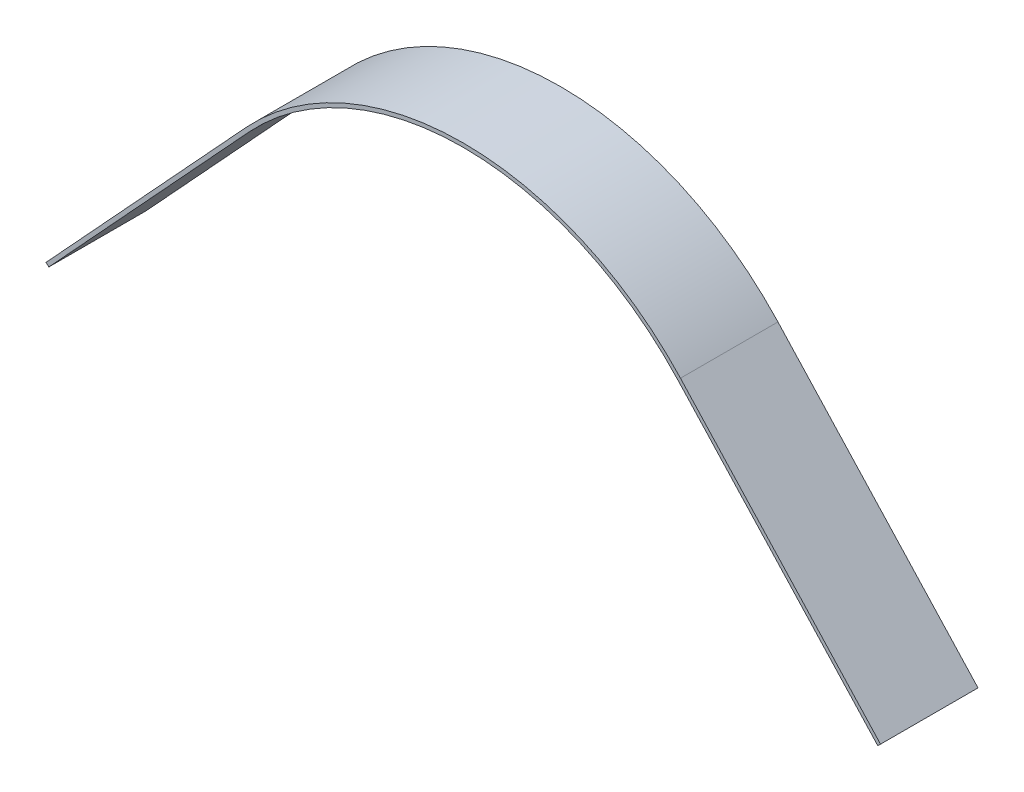
ISO-10303-21;
HEADER;
FILE_DESCRIPTION(('STEP AP214'),'2;1');
FILE_NAME('part.step','',(''),(''),'','','');
FILE_SCHEMA(('AUTOMOTIVE_DESIGN { 1 0 10303 214 1 1 1 1 }'));
ENDSEC;
DATA;
#1=APPLICATION_CONTEXT('core data for automotive mechanical design processes');
#2=APPLICATION_PROTOCOL_DEFINITION('international standard','automotive_design',2000,#1);
#3=PRODUCT_CONTEXT('',#1,'mechanical');
#4=PRODUCT('Part','Part','',(#3));
#5=PRODUCT_RELATED_PRODUCT_CATEGORY('part','',(#4));
#6=PRODUCT_DEFINITION_FORMATION('','',#4);
#7=PRODUCT_DEFINITION_CONTEXT('part definition',#1,'design');
#8=PRODUCT_DEFINITION('design','',#6,#7);
#9=PRODUCT_DEFINITION_SHAPE('','',#8);
#10=(LENGTH_UNIT() NAMED_UNIT(*) SI_UNIT(.MILLI.,.METRE.));
#11=(NAMED_UNIT(*) PLANE_ANGLE_UNIT() SI_UNIT($,.RADIAN.));
#12=(NAMED_UNIT(*) SI_UNIT($,.STERADIAN.) SOLID_ANGLE_UNIT());
#13=UNCERTAINTY_MEASURE_WITH_UNIT(LENGTH_MEASURE(1.E-05),#10,'distance_accuracy_value','');
#14=(GEOMETRIC_REPRESENTATION_CONTEXT(3) GLOBAL_UNCERTAINTY_ASSIGNED_CONTEXT((#13)) GLOBAL_UNIT_ASSIGNED_CONTEXT((#10,
#11,#12)) REPRESENTATION_CONTEXT('',''));
#15=CARTESIAN_POINT('',(0.,0.,0.));
#16=DIRECTION('',(0.,0.,1.));
#17=DIRECTION('',(1.,0.,0.));
#18=AXIS2_PLACEMENT_3D('',#15,#16,#17);
#19=CARTESIAN_POINT('',(55.8669255547084,51.5255919817005,12.7));
#20=DIRECTION('',(0.735091125719847,0.67796831554869,0.));
#21=DIRECTION('',(-0.67796831554869,0.735091125719847,0.));
#22=AXIS2_PLACEMENT_3D('',#19,#20,#21);
#23=PLANE('',#22);
#24=DIRECTION('',(0.67796831554869,-0.735091125719847,0.));
#25=VECTOR('',#24,1.);
#26=CARTESIAN_POINT('',(55.8669255547084,51.5255919817005,-12.7));
#27=LINE('',#26,#25);
#28=CARTESIAN_POINT('',(55.8669255547084,51.5255919817005,-12.7));
#29=VERTEX_POINT('',#28);
#30=CARTESIAN_POINT('',(108.,-5.,-12.7));
#31=VERTEX_POINT('',#30);
#32=EDGE_CURVE('E132',#29,#31,#27,.T.);
#33=ORIENTED_EDGE('',*,*,#32,.T.);
#34=DIRECTION('',(0.,0.,-1.));
#35=VECTOR('',#34,1.);
#36=CARTESIAN_POINT('',(108.,-5.,12.7));
#37=LINE('',#36,#35);
#38=CARTESIAN_POINT('',(108.,-5.,12.7));
#39=VERTEX_POINT('',#38);
#40=EDGE_CURVE('E11',#39,#31,#37,.T.);
#41=ORIENTED_EDGE('',*,*,#40,.F.);
#42=DIRECTION('',(0.67796831554869,-0.735091125719847,0.));
#43=VECTOR('',#42,1.);
#44=CARTESIAN_POINT('',(55.8669255547084,51.5255919817005,12.7));
#45=LINE('',#44,#43);
#46=CARTESIAN_POINT('',(55.8669255547084,51.5255919817005,12.7));
#47=VERTEX_POINT('',#46);
#48=EDGE_CURVE('E90',#47,#39,#45,.T.);
#49=ORIENTED_EDGE('',*,*,#48,.F.);
#50=DIRECTION('',(0.,0.,-1.));
#51=VECTOR('',#50,1.);
#52=CARTESIAN_POINT('',(55.8669255547084,51.5255919817005,12.7));
#53=LINE('',#52,#51);
#54=EDGE_CURVE('E131',#47,#29,#53,.T.);
#55=ORIENTED_EDGE('',*,*,#54,.T.);
#56=EDGE_LOOP('',(#33,#41,#49,#55));
#57=FACE_BOUND('',#56,.T.);
#58=ADVANCED_FACE('F35',(#57),#23,.F.);
#59=CARTESIAN_POINT('',(108.73509112572,-4.32203168445131,12.7));
#60=DIRECTION('',(0.677968315548683,-0.735091125719853,0.));
#61=DIRECTION('',(0.735091125719853,0.677968315548683,0.));
#62=AXIS2_PLACEMENT_3D('',#59,#60,#61);
#63=PLANE('',#62);
#64=DIRECTION('',(-0.735091125719853,-0.677968315548683,0.));
#65=VECTOR('',#64,1.);
#66=CARTESIAN_POINT('',(108.73509112572,-4.32203168445131,-12.7));
#67=LINE('',#66,#65);
#68=CARTESIAN_POINT('',(108.73509112572,-4.32203168445131,-12.7));
#69=VERTEX_POINT('',#68);
#70=EDGE_CURVE('E135',#69,#31,#67,.T.);
#71=ORIENTED_EDGE('',*,*,#70,.F.);
#72=DIRECTION('',(0.,0.,-1.));
#73=VECTOR('',#72,1.);
#74=CARTESIAN_POINT('',(108.73509112572,-4.32203168445131,12.7));
#75=LINE('',#74,#73);
#76=CARTESIAN_POINT('',(108.73509112572,-4.32203168445131,12.7));
#77=VERTEX_POINT('',#76);
#78=EDGE_CURVE('E43',#77,#69,#75,.T.);
#79=ORIENTED_EDGE('',*,*,#78,.F.);
#80=DIRECTION('',(-0.735091125719853,-0.677968315548683,0.));
#81=VECTOR('',#80,1.);
#82=CARTESIAN_POINT('',(108.73509112572,-4.32203168445131,12.7));
#83=LINE('',#82,#81);
#84=EDGE_CURVE('E174',#77,#39,#83,.T.);
#85=ORIENTED_EDGE('',*,*,#84,.T.);
#86=ORIENTED_EDGE('',*,*,#40,.T.);
#87=EDGE_LOOP('',(#71,#79,#85,#86));
#88=FACE_BOUND('',#87,.T.);
#89=ADVANCED_FACE('F165',(#88),#63,.T.);
#90=CARTESIAN_POINT('',(56.6020166804282,52.2035602972492,12.7));
#91=DIRECTION('',(0.735091125719847,0.67796831554869,0.));
#92=DIRECTION('',(-0.67796831554869,0.735091125719847,0.));
#93=AXIS2_PLACEMENT_3D('',#90,#91,#92);
#94=PLANE('',#93);
#95=DIRECTION('',(0.67796831554869,-0.735091125719847,0.));
#96=VECTOR('',#95,1.);
#97=CARTESIAN_POINT('',(56.6020166804282,52.2035602972492,-12.7));
#98=LINE('',#97,#96);
#99=CARTESIAN_POINT('',(56.6020166804282,52.2035602972492,-12.7));
#100=VERTEX_POINT('',#99);
#101=EDGE_CURVE('E138',#100,#69,#98,.T.);
#102=ORIENTED_EDGE('',*,*,#101,.F.);
#103=DIRECTION('',(0.,0.,-1.));
#104=VECTOR('',#103,1.);
#105=CARTESIAN_POINT('',(56.6020166804282,52.2035602972492,12.7));
#106=LINE('',#105,#104);
#107=CARTESIAN_POINT('',(56.6020166804282,52.2035602972492,12.7));
#108=VERTEX_POINT('',#107);
#109=EDGE_CURVE('E155',#108,#100,#106,.T.);
#110=ORIENTED_EDGE('',*,*,#109,.F.);
#111=DIRECTION('',(0.67796831554869,-0.735091125719847,0.));
#112=VECTOR('',#111,1.);
#113=CARTESIAN_POINT('',(56.6020166804282,52.2035602972492,12.7));
#114=LINE('',#113,#112);
#115=EDGE_CURVE('E162',#108,#77,#114,.T.);
#116=ORIENTED_EDGE('',*,*,#115,.T.);
#117=ORIENTED_EDGE('',*,*,#78,.T.);
#118=EDGE_LOOP('',(#102,#110,#116,#117));
#119=FACE_BOUND('',#118,.T.);
#120=ADVANCED_FACE('F160',(#119),#94,.T.);
#121=CARTESIAN_POINT('',(0.,0.,12.7));
#122=DIRECTION('',(0.,0.,-1.));
#123=DIRECTION('',(-1.,0.,0.));
#124=AXIS2_PLACEMENT_3D('',#121,#122,#123);
#125=CYLINDRICAL_SURFACE('',#124,77.);
#126=CARTESIAN_POINT('',(0.,0.,-12.7));
#127=DIRECTION('',(0.,0.,1.));
#128=DIRECTION('',(1.,0.,0.));
#129=AXIS2_PLACEMENT_3D('',#126,#127,#128);
#130=CIRCLE('',#129,77.);
#131=CARTESIAN_POINT('',(-56.6020166804282,52.2035602972491,-12.7));
#132=VERTEX_POINT('',#131);
#133=EDGE_CURVE('E141',#132,#100,#130,.F.);
#134=ORIENTED_EDGE('',*,*,#133,.F.);
#135=DIRECTION('',(0.,0.,-1.));
#136=VECTOR('',#135,1.);
#137=CARTESIAN_POINT('',(-56.6020166804282,52.2035602972491,12.7));
#138=LINE('',#137,#136);
#139=CARTESIAN_POINT('',(-56.6020166804282,52.2035602972491,12.7));
#140=VERTEX_POINT('',#139);
#141=EDGE_CURVE('E153',#140,#132,#138,.T.);
#142=ORIENTED_EDGE('',*,*,#141,.F.);
#143=CARTESIAN_POINT('',(0.,0.,12.7));
#144=DIRECTION('',(0.,0.,1.));
#145=DIRECTION('',(1.,0.,0.));
#146=AXIS2_PLACEMENT_3D('',#143,#144,#145);
#147=CIRCLE('',#146,77.);
#148=EDGE_CURVE('E126',#140,#108,#147,.F.);
#149=ORIENTED_EDGE('',*,*,#148,.T.);
#150=ORIENTED_EDGE('',*,*,#109,.T.);
#151=EDGE_LOOP('',(#134,#142,#149,#150));
#152=FACE_BOUND('',#151,.T.);
#153=ADVANCED_FACE('F172',(#152),#125,.T.);
#154=CARTESIAN_POINT('',(-56.6020166804282,52.2035602972491,12.7));
#155=DIRECTION('',(-0.735091125719847,0.67796831554869,0.));
#156=DIRECTION('',(-0.67796831554869,-0.735091125719847,0.));
#157=AXIS2_PLACEMENT_3D('',#154,#155,#156);
#158=PLANE('',#157);
#159=DIRECTION('',(0.67796831554869,0.735091125719847,0.));
#160=VECTOR('',#159,1.);
#161=CARTESIAN_POINT('',(-56.6020166804282,52.2035602972491,-12.7));
#162=LINE('',#161,#160);
#163=CARTESIAN_POINT('',(-108.73509112572,-4.32203168445131,-12.7));
#164=VERTEX_POINT('',#163);
#165=EDGE_CURVE('E144',#164,#132,#162,.T.);
#166=ORIENTED_EDGE('',*,*,#165,.F.);
#167=DIRECTION('',(0.,0.,-1.));
#168=VECTOR('',#167,1.);
#169=CARTESIAN_POINT('',(-108.73509112572,-4.32203168445131,12.7));
#170=LINE('',#169,#168);
#171=CARTESIAN_POINT('',(-108.73509112572,-4.32203168445131,12.7));
#172=VERTEX_POINT('',#171);
#173=EDGE_CURVE('E114',#172,#164,#170,.T.);
#174=ORIENTED_EDGE('',*,*,#173,.F.);
#175=DIRECTION('',(0.67796831554869,0.735091125719847,0.));
#176=VECTOR('',#175,1.);
#177=CARTESIAN_POINT('',(-56.6020166804282,52.2035602972491,12.7));
#178=LINE('',#177,#176);
#179=EDGE_CURVE('E124',#172,#140,#178,.T.);
#180=ORIENTED_EDGE('',*,*,#179,.T.);
#181=ORIENTED_EDGE('',*,*,#141,.T.);
#182=EDGE_LOOP('',(#166,#174,#180,#181));
#183=FACE_BOUND('',#182,.T.);
#184=ADVANCED_FACE('F179',(#183),#158,.T.);
#185=CARTESIAN_POINT('',(-108.,-5.,12.7));
#186=DIRECTION('',(-0.677968315548683,-0.735091125719853,0.));
#187=DIRECTION('',(0.735091125719853,-0.677968315548683,0.));
#188=AXIS2_PLACEMENT_3D('',#185,#186,#187);
#189=PLANE('',#188);
#190=DIRECTION('',(-0.735091125719853,0.677968315548683,0.));
#191=VECTOR('',#190,1.);
#192=CARTESIAN_POINT('',(-108.,-5.,-12.7));
#193=LINE('',#192,#191);
#194=CARTESIAN_POINT('',(-108.,-5.,-12.7));
#195=VERTEX_POINT('',#194);
#196=EDGE_CURVE('E113',#195,#164,#193,.T.);
#197=ORIENTED_EDGE('',*,*,#196,.F.);
#198=DIRECTION('',(0.,0.,-1.));
#199=VECTOR('',#198,1.);
#200=CARTESIAN_POINT('',(-108.,-5.,12.7));
#201=LINE('',#200,#199);
#202=CARTESIAN_POINT('',(-108.,-5.,12.7));
#203=VERTEX_POINT('',#202);
#204=EDGE_CURVE('E107',#203,#195,#201,.T.);
#205=ORIENTED_EDGE('',*,*,#204,.F.);
#206=DIRECTION('',(-0.735091125719853,0.677968315548683,0.));
#207=VECTOR('',#206,1.);
#208=CARTESIAN_POINT('',(-108.,-5.,12.7));
#209=LINE('',#208,#207);
#210=EDGE_CURVE('E111',#203,#172,#209,.T.);
#211=ORIENTED_EDGE('',*,*,#210,.T.);
#212=ORIENTED_EDGE('',*,*,#173,.T.);
#213=EDGE_LOOP('',(#197,#205,#211,#212));
#214=FACE_BOUND('',#213,.T.);
#215=ADVANCED_FACE('F109',(#214),#189,.T.);
#216=CARTESIAN_POINT('',(-55.8669255547084,51.5255919817005,12.7));
#217=DIRECTION('',(-0.735091125719847,0.67796831554869,0.));
#218=DIRECTION('',(-0.67796831554869,-0.735091125719847,0.));
#219=AXIS2_PLACEMENT_3D('',#216,#217,#218);
#220=PLANE('',#219);
#221=DIRECTION('',(0.67796831554869,0.735091125719847,0.));
#222=VECTOR('',#221,1.);
#223=CARTESIAN_POINT('',(-55.8669255547084,51.5255919817005,-12.7));
#224=LINE('',#223,#222);
#225=CARTESIAN_POINT('',(-55.8669255547084,51.5255919817005,-12.7));
#226=VERTEX_POINT('',#225);
#227=EDGE_CURVE('E78',#195,#226,#224,.T.);
#228=ORIENTED_EDGE('',*,*,#227,.T.);
#229=DIRECTION('',(0.,0.,-1.));
#230=VECTOR('',#229,1.);
#231=CARTESIAN_POINT('',(-55.8669255547084,51.5255919817005,12.7));
#232=LINE('',#231,#230);
#233=CARTESIAN_POINT('',(-55.8669255547084,51.5255919817005,12.7));
#234=VERTEX_POINT('',#233);
#235=EDGE_CURVE('E115',#234,#226,#232,.T.);
#236=ORIENTED_EDGE('',*,*,#235,.F.);
#237=DIRECTION('',(0.67796831554869,0.735091125719847,0.));
#238=VECTOR('',#237,1.);
#239=CARTESIAN_POINT('',(-55.8669255547084,51.5255919817005,12.7));
#240=LINE('',#239,#238);
#241=EDGE_CURVE('E117',#203,#234,#240,.T.);
#242=ORIENTED_EDGE('',*,*,#241,.F.);
#243=ORIENTED_EDGE('',*,*,#204,.T.);
#244=EDGE_LOOP('',(#228,#236,#242,#243));
#245=FACE_BOUND('',#244,.T.);
#246=ADVANCED_FACE('F118',(#245),#220,.F.);
#247=CARTESIAN_POINT('',(0.,0.,12.7));
#248=DIRECTION('',(0.,0.,-1.));
#249=DIRECTION('',(-1.,0.,0.));
#250=AXIS2_PLACEMENT_3D('',#247,#248,#249);
#251=CYLINDRICAL_SURFACE('',#250,76.);
#252=CARTESIAN_POINT('',(0.,0.,-12.7));
#253=DIRECTION('',(0.,0.,-1.));
#254=DIRECTION('',(1.,0.,0.));
#255=AXIS2_PLACEMENT_3D('',#252,#253,#254);
#256=CIRCLE('',#255,76.);
#257=EDGE_CURVE('E84',#226,#29,#256,.T.);
#258=ORIENTED_EDGE('',*,*,#257,.T.);
#259=ORIENTED_EDGE('',*,*,#54,.F.);
#260=CARTESIAN_POINT('',(0.,0.,12.7));
#261=DIRECTION('',(0.,0.,-1.));
#262=DIRECTION('',(1.,0.,0.));
#263=AXIS2_PLACEMENT_3D('',#260,#261,#262);
#264=CIRCLE('',#263,76.);
#265=EDGE_CURVE('E51',#234,#47,#264,.T.);
#266=ORIENTED_EDGE('',*,*,#265,.F.);
#267=ORIENTED_EDGE('',*,*,#235,.T.);
#268=EDGE_LOOP('',(#258,#259,#266,#267));
#269=FACE_BOUND('',#268,.T.);
#270=ADVANCED_FACE('F181',(#269),#251,.F.);
#271=CARTESIAN_POINT('',(0.,0.,12.7));
#272=DIRECTION('',(0.,0.,1.));
#273=DIRECTION('',(1.,0.,0.));
#274=AXIS2_PLACEMENT_3D('',#271,#272,#273);
#275=PLANE('',#274);
#276=ORIENTED_EDGE('',*,*,#48,.T.);
#277=ORIENTED_EDGE('',*,*,#84,.F.);
#278=ORIENTED_EDGE('',*,*,#115,.F.);
#279=ORIENTED_EDGE('',*,*,#148,.F.);
#280=ORIENTED_EDGE('',*,*,#179,.F.);
#281=ORIENTED_EDGE('',*,*,#210,.F.);
#282=ORIENTED_EDGE('',*,*,#241,.T.);
#283=ORIENTED_EDGE('',*,*,#265,.T.);
#284=EDGE_LOOP('',(#276,#277,#278,#279,#280,#281,#282,#283));
#285=FACE_BOUND('',#284,.T.);
#286=ADVANCED_FACE('F121',(#285),#275,.T.);
#287=CARTESIAN_POINT('',(0.,0.,-12.7));
#288=DIRECTION('',(0.,0.,1.));
#289=DIRECTION('',(1.,0.,0.));
#290=AXIS2_PLACEMENT_3D('',#287,#288,#289);
#291=PLANE('',#290);
#292=ORIENTED_EDGE('',*,*,#32,.F.);
#293=ORIENTED_EDGE('',*,*,#257,.F.);
#294=ORIENTED_EDGE('',*,*,#227,.F.);
#295=ORIENTED_EDGE('',*,*,#196,.T.);
#296=ORIENTED_EDGE('',*,*,#165,.T.);
#297=ORIENTED_EDGE('',*,*,#133,.T.);
#298=ORIENTED_EDGE('',*,*,#101,.T.);
#299=ORIENTED_EDGE('',*,*,#70,.T.);
#300=EDGE_LOOP('',(#292,#293,#294,#295,#296,#297,#298,#299));
#301=FACE_BOUND('',#300,.T.);
#302=ADVANCED_FACE('F168',(#301),#291,.F.);
#303=CLOSED_SHELL('',(#58,#89,#120,#153,#184,#215,#246,#270,#286,#302));
#304=MANIFOLD_SOLID_BREP('B2',#303);
#305=ADVANCED_BREP_SHAPE_REPRESENTATION('',(#18,#304),#14);
#306=SHAPE_DEFINITION_REPRESENTATION(#9,#305);
ENDSEC;
END-ISO-10303-21;
